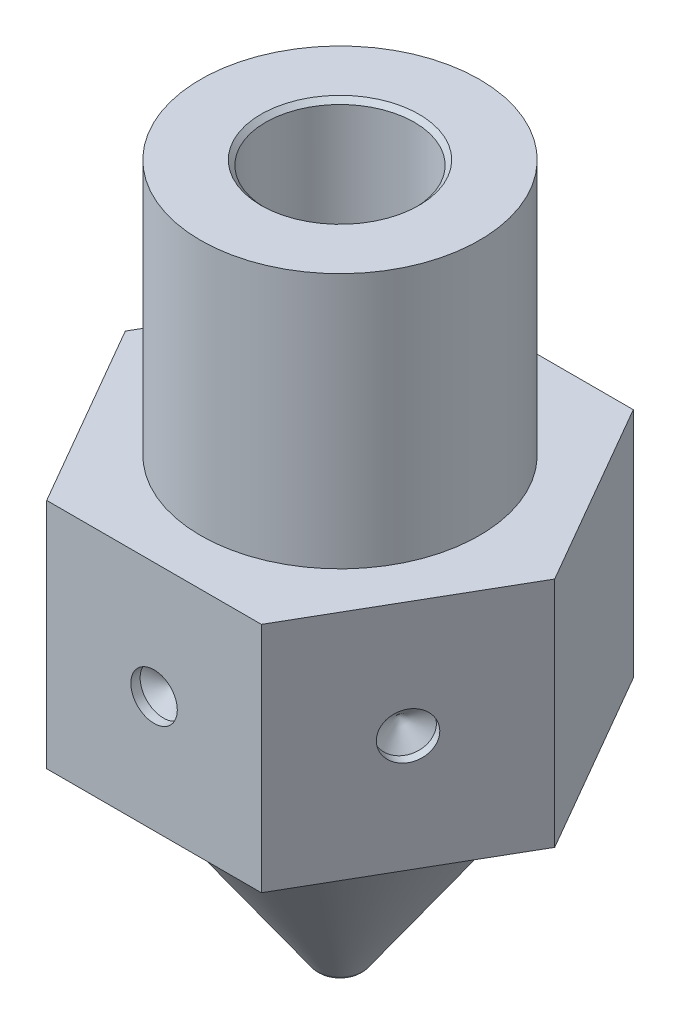
ISO-10303-21;
HEADER;
FILE_DESCRIPTION(('STEP AP214'),'2;1');
FILE_NAME('part.step','',(''),(''),'','','');
FILE_SCHEMA(('AUTOMOTIVE_DESIGN { 1 0 10303 214 1 1 1 1 }'));
ENDSEC;
DATA;
#1=APPLICATION_CONTEXT('core data for automotive mechanical design processes');
#2=APPLICATION_PROTOCOL_DEFINITION('international standard','automotive_design',2000,#1);
#3=PRODUCT_CONTEXT('',#1,'mechanical');
#4=PRODUCT('Part','Part','',(#3));
#5=PRODUCT_RELATED_PRODUCT_CATEGORY('part','',(#4));
#6=PRODUCT_DEFINITION_FORMATION('','',#4);
#7=PRODUCT_DEFINITION_CONTEXT('part definition',#1,'design');
#8=PRODUCT_DEFINITION('design','',#6,#7);
#9=PRODUCT_DEFINITION_SHAPE('','',#8);
#10=(LENGTH_UNIT() NAMED_UNIT(*) SI_UNIT(.MILLI.,.METRE.));
#11=(NAMED_UNIT(*) PLANE_ANGLE_UNIT() SI_UNIT($,.RADIAN.));
#12=(NAMED_UNIT(*) SI_UNIT($,.STERADIAN.) SOLID_ANGLE_UNIT());
#13=UNCERTAINTY_MEASURE_WITH_UNIT(LENGTH_MEASURE(1.E-05),#10,'distance_accuracy_value','');
#14=(GEOMETRIC_REPRESENTATION_CONTEXT(3) GLOBAL_UNCERTAINTY_ASSIGNED_CONTEXT((#13)) GLOBAL_UNIT_ASSIGNED_CONTEXT((#10,
#11,#12)) REPRESENTATION_CONTEXT('',''));
#15=CARTESIAN_POINT('',(0.,0.,0.));
#16=DIRECTION('',(0.,0.,1.));
#17=DIRECTION('',(1.,0.,0.));
#18=AXIS2_PLACEMENT_3D('',#15,#16,#17);
#19=CARTESIAN_POINT('',(3.55710403710923,4.5,0.));
#20=DIRECTION('',(0.,-1.,0.));
#21=DIRECTION('',(0.,0.,-1.));
#22=AXIS2_PLACEMENT_3D('',#19,#20,#21);
#23=PLANE('',#22);
#24=CARTESIAN_POINT('',(0.,4.5,0.));
#25=DIRECTION('',(0.,-1.,0.));
#26=DIRECTION('',(0.,0.,-1.));
#27=AXIS2_PLACEMENT_3D('',#24,#25,#26);
#28=CIRCLE('',#27,3.55710403710923);
#29=CARTESIAN_POINT('',(0.,4.5,-3.55710403710923));
#30=VERTEX_POINT('',#29);
#31=EDGE_CURVE('E183',#30,#30,#28,.T.);
#32=ORIENTED_EDGE('',*,*,#31,.F.);
#33=EDGE_LOOP('',(#32));
#34=FACE_BOUND('',#33,.T.);
#35=DIRECTION('',(1.,0.,0.));
#36=VECTOR('',#35,1.);
#37=CARTESIAN_POINT('',(3.55710403710923,4.5,-4.));
#38=LINE('',#37,#36);
#39=CARTESIAN_POINT('',(-2.3094010767585,4.5,-4.));
#40=VERTEX_POINT('',#39);
#41=CARTESIAN_POINT('',(2.3094010767585,4.5,-4.));
#42=VERTEX_POINT('',#41);
#43=EDGE_CURVE('E127',#40,#42,#38,.T.);
#44=ORIENTED_EDGE('',*,*,#43,.T.);
#45=DIRECTION('',(0.5,0.,0.866025403784438));
#46=VECTOR('',#45,1.);
#47=CARTESIAN_POINT('',(4.35337762441506,4.5,-0.459728769979613));
#48=LINE('',#47,#46);
#49=CARTESIAN_POINT('',(4.61880215351701,4.5,0.));
#50=VERTEX_POINT('',#49);
#51=EDGE_CURVE('E163',#42,#50,#48,.T.);
#52=ORIENTED_EDGE('',*,*,#51,.T.);
#53=DIRECTION('',(-0.5,0.,0.866025403784439));
#54=VECTOR('',#53,1.);
#55=CARTESIAN_POINT('',(4.35337762441506,4.5,0.459728769979613));
#56=LINE('',#55,#54);
#57=CARTESIAN_POINT('',(2.30940107675851,4.5,4.));
#58=VERTEX_POINT('',#57);
#59=EDGE_CURVE('E159',#50,#58,#56,.T.);
#60=ORIENTED_EDGE('',*,*,#59,.T.);
#61=DIRECTION('',(-1.,0.,0.));
#62=VECTOR('',#61,1.);
#63=CARTESIAN_POINT('',(3.55710403710923,4.5,4.));
#64=LINE('',#63,#62);
#65=CARTESIAN_POINT('',(-2.3094010767585,4.5,4.));
#66=VERTEX_POINT('',#65);
#67=EDGE_CURVE('E155',#58,#66,#64,.T.);
#68=ORIENTED_EDGE('',*,*,#67,.T.);
#69=DIRECTION('',(-0.500000000000001,0.,-0.866025403784438));
#70=VECTOR('',#69,1.);
#71=CARTESIAN_POINT('',(-2.57482560586044,4.5,3.54027123002039));
#72=LINE('',#71,#70);
#73=CARTESIAN_POINT('',(-4.61880215351701,4.5,0.));
#74=VERTEX_POINT('',#73);
#75=EDGE_CURVE('E151',#66,#74,#72,.T.);
#76=ORIENTED_EDGE('',*,*,#75,.T.);
#77=DIRECTION('',(0.5,0.,-0.866025403784439));
#78=VECTOR('',#77,1.);
#79=CARTESIAN_POINT('',(-2.57482560586045,4.5,-3.54027123002039));
#80=LINE('',#79,#78);
#81=EDGE_CURVE('E147',#74,#40,#80,.T.);
#82=ORIENTED_EDGE('',*,*,#81,.T.);
#83=EDGE_LOOP('',(#44,#52,#60,#68,#76,#82));
#84=FACE_BOUND('',#83,.T.);
#85=ADVANCED_FACE('F39',(#34,#84),#23,.T.);
#86=CARTESIAN_POINT('',(7.05814172815778,9.5,0.));
#87=DIRECTION('',(0.,1.,0.));
#88=DIRECTION('',(0.,0.,1.));
#89=AXIS2_PLACEMENT_3D('',#86,#87,#88);
#90=PLANE('',#89);
#91=CARTESIAN_POINT('',(0.,9.5,0.));
#92=DIRECTION('',(0.,-1.,0.));
#93=DIRECTION('',(0.,0.,-1.));
#94=AXIS2_PLACEMENT_3D('',#91,#92,#93);
#95=CIRCLE('',#94,3.);
#96=CARTESIAN_POINT('',(0.,9.5,-3.));
#97=VERTEX_POINT('',#96);
#98=EDGE_CURVE('E179',#97,#97,#95,.T.);
#99=ORIENTED_EDGE('',*,*,#98,.T.);
#100=EDGE_LOOP('',(#99));
#101=FACE_BOUND('',#100,.T.);
#102=DIRECTION('',(0.5,0.,-0.866025403784439));
#103=VECTOR('',#102,1.);
#104=CARTESIAN_POINT('',(5.2286370471772,9.5,-1.05626502004782));
#105=LINE('',#104,#103);
#106=CARTESIAN_POINT('',(2.30940107675851,9.5,4.));
#107=VERTEX_POINT('',#106);
#108=CARTESIAN_POINT('',(4.61880215351701,9.5,0.));
#109=VERTEX_POINT('',#108);
#110=EDGE_CURVE('E213',#107,#109,#105,.T.);
#111=ORIENTED_EDGE('',*,*,#110,.T.);
#112=DIRECTION('',(-0.5,0.,-0.866025403784438));
#113=VECTOR('',#112,1.);
#114=CARTESIAN_POINT('',(5.2286370471772,9.5,1.05626502004782));
#115=LINE('',#114,#113);
#116=CARTESIAN_POINT('',(2.3094010767585,9.5,-4.));
#117=VERTEX_POINT('',#116);
#118=EDGE_CURVE('E217',#109,#117,#115,.T.);
#119=ORIENTED_EDGE('',*,*,#118,.T.);
#120=DIRECTION('',(-1.,0.,0.));
#121=VECTOR('',#120,1.);
#122=CARTESIAN_POINT('',(7.05814172815778,9.5,-4.));
#123=LINE('',#122,#121);
#124=CARTESIAN_POINT('',(-2.3094010767585,9.5,-4.));
#125=VERTEX_POINT('',#124);
#126=EDGE_CURVE('E198',#117,#125,#123,.T.);
#127=ORIENTED_EDGE('',*,*,#126,.T.);
#128=DIRECTION('',(-0.5,0.,0.866025403784439));
#129=VECTOR('',#128,1.);
#130=CARTESIAN_POINT('',(-1.69956618309831,9.5,-5.05626502004782));
#131=LINE('',#130,#129);
#132=CARTESIAN_POINT('',(-4.61880215351701,9.5,0.));
#133=VERTEX_POINT('',#132);
#134=EDGE_CURVE('E202',#125,#133,#131,.T.);
#135=ORIENTED_EDGE('',*,*,#134,.T.);
#136=DIRECTION('',(0.500000000000001,0.,0.866025403784438));
#137=VECTOR('',#136,1.);
#138=CARTESIAN_POINT('',(-1.6995661830983,9.5,5.05626502004782));
#139=LINE('',#138,#137);
#140=CARTESIAN_POINT('',(-2.3094010767585,9.5,4.));
#141=VERTEX_POINT('',#140);
#142=EDGE_CURVE('E206',#133,#141,#139,.T.);
#143=ORIENTED_EDGE('',*,*,#142,.T.);
#144=DIRECTION('',(1.,0.,0.));
#145=VECTOR('',#144,1.);
#146=CARTESIAN_POINT('',(7.05814172815779,9.5,4.));
#147=LINE('',#146,#145);
#148=EDGE_CURVE('E209',#141,#107,#147,.T.);
#149=ORIENTED_EDGE('',*,*,#148,.T.);
#150=EDGE_LOOP('',(#111,#119,#127,#135,#143,#149));
#151=FACE_BOUND('',#150,.T.);
#152=ADVANCED_FACE('F241',(#101,#151),#90,.T.);
#153=CARTESIAN_POINT('',(0.,0.,0.));
#154=DIRECTION('',(0.,-1.,0.));
#155=DIRECTION('',(0.,0.,-1.));
#156=AXIS2_PLACEMENT_3D('',#153,#154,#155);
#157=CYLINDRICAL_SURFACE('',#156,0.2);
#158=CARTESIAN_POINT('',(0.,0.,0.));
#159=DIRECTION('',(0.,-1.,0.));
#160=DIRECTION('',(0.,0.,-1.));
#161=AXIS2_PLACEMENT_3D('',#158,#159,#160);
#162=CIRCLE('',#161,0.2);
#163=CARTESIAN_POINT('',(0.,0.,-0.2));
#164=VERTEX_POINT('',#163);
#165=EDGE_CURVE('E194',#164,#164,#162,.T.);
#166=ORIENTED_EDGE('',*,*,#165,.T.);
#167=EDGE_LOOP('',(#166));
#168=FACE_BOUND('',#167,.T.);
#169=CARTESIAN_POINT('',(0.,0.8,0.));
#170=DIRECTION('',(0.,-1.,0.));
#171=DIRECTION('',(0.,0.,-1.));
#172=AXIS2_PLACEMENT_3D('',#169,#170,#171);
#173=CIRCLE('',#172,0.2);
#174=CARTESIAN_POINT('',(0.,0.8,-0.2));
#175=VERTEX_POINT('',#174);
#176=EDGE_CURVE('E167',#175,#175,#173,.T.);
#177=ORIENTED_EDGE('',*,*,#176,.F.);
#178=EDGE_LOOP('',(#177));
#179=FACE_BOUND('',#178,.T.);
#180=ADVANCED_FACE('F247',(#168,#179),#157,.F.);
#181=CARTESIAN_POINT('',(0.2,0.,0.));
#182=DIRECTION('',(0.,-1.,0.));
#183=DIRECTION('',(0.,0.,-1.));
#184=AXIS2_PLACEMENT_3D('',#181,#182,#183);
#185=PLANE('',#184);
#186=CARTESIAN_POINT('',(0.,0.,0.));
#187=DIRECTION('',(0.,-1.,0.));
#188=DIRECTION('',(0.,0.,-1.));
#189=AXIS2_PLACEMENT_3D('',#186,#187,#188);
#190=CIRCLE('',#189,0.25);
#191=CARTESIAN_POINT('',(0.,0.,-0.25));
#192=VERTEX_POINT('',#191);
#193=EDGE_CURVE('E191',#192,#192,#190,.T.);
#194=ORIENTED_EDGE('',*,*,#193,.T.);
#195=EDGE_LOOP('',(#194));
#196=FACE_BOUND('',#195,.T.);
#197=ORIENTED_EDGE('',*,*,#165,.F.);
#198=EDGE_LOOP('',(#197));
#199=FACE_BOUND('',#198,.T.);
#200=ADVANCED_FACE('F262',(#196,#199),#185,.T.);
#201=CARTESIAN_POINT('',(0.,0.3,0.));
#202=DIRECTION('',(0.,-1.,0.));
#203=DIRECTION('',(0.,0.,-1.));
#204=AXIS2_PLACEMENT_3D('',#201,#202,#203);
#205=DEGENERATE_TOROIDAL_SURFACE('',#204,0.25,0.3,.T.);
#206=CARTESIAN_POINT('',(0.,0.127927069094686,0.));
#207=DIRECTION('',(0.,-1.,0.));
#208=DIRECTION('',(0.,0.,-1.));
#209=AXIS2_PLACEMENT_3D('',#206,#207,#208);
#210=CIRCLE('',#209,0.495745613286697);
#211=CARTESIAN_POINT('',(0.,0.127927069094686,-0.495745613286697));
#212=VERTEX_POINT('',#211);
#213=EDGE_CURVE('E187',#212,#212,#210,.T.);
#214=ORIENTED_EDGE('',*,*,#213,.T.);
#215=EDGE_LOOP('',(#214));
#216=FACE_BOUND('',#215,.T.);
#217=ORIENTED_EDGE('',*,*,#193,.F.);
#218=EDGE_LOOP('',(#217));
#219=FACE_BOUND('',#218,.T.);
#220=ADVANCED_FACE('F258',(#216,#219),#205,.T.);
#221=CARTESIAN_POINT('',(0.,0.127927069094686,0.));
#222=DIRECTION('',(0.,1.,0.));
#223=DIRECTION('',(0.,0.,1.));
#224=AXIS2_PLACEMENT_3D('',#221,#222,#223);
#225=CONICAL_SURFACE('',#224,0.495745613286697,0.610865238198017);
#226=ORIENTED_EDGE('',*,*,#31,.T.);
#227=EDGE_LOOP('',(#226));
#228=FACE_BOUND('',#227,.T.);
#229=ORIENTED_EDGE('',*,*,#213,.F.);
#230=EDGE_LOOP('',(#229));
#231=FACE_BOUND('',#230,.T.);
#232=ADVANCED_FACE('F254',(#228,#231),#225,.T.);
#233=CARTESIAN_POINT('',(0.,0.,0.));
#234=DIRECTION('',(0.,-1.,0.));
#235=DIRECTION('',(0.,0.,-1.));
#236=AXIS2_PLACEMENT_3D('',#233,#234,#235);
#237=CYLINDRICAL_SURFACE('',#236,3.);
#238=CARTESIAN_POINT('',(0.,15.,0.));
#239=DIRECTION('',(0.,-1.,0.));
#240=DIRECTION('',(0.,0.,-1.));
#241=AXIS2_PLACEMENT_3D('',#238,#239,#240);
#242=CIRCLE('',#241,3.);
#243=CARTESIAN_POINT('',(0.,15.,-3.));
#244=VERTEX_POINT('',#243);
#245=EDGE_CURVE('E175',#244,#244,#242,.T.);
#246=ORIENTED_EDGE('',*,*,#245,.T.);
#247=EDGE_LOOP('',(#246));
#248=FACE_BOUND('',#247,.T.);
#249=ORIENTED_EDGE('',*,*,#98,.F.);
#250=EDGE_LOOP('',(#249));
#251=FACE_BOUND('',#250,.T.);
#252=ADVANCED_FACE('F257',(#248,#251),#237,.T.);
#253=CARTESIAN_POINT('',(3.,15.,0.));
#254=DIRECTION('',(0.,1.,0.));
#255=DIRECTION('',(0.,0.,1.));
#256=AXIS2_PLACEMENT_3D('',#253,#254,#255);
#257=PLANE('',#256);
#258=CARTESIAN_POINT('',(0.,15.,0.));
#259=DIRECTION('',(0.,1.,0.));
#260=DIRECTION('',(0.,0.,1.));
#261=AXIS2_PLACEMENT_3D('',#258,#259,#260);
#262=CIRCLE('',#261,1.7);
#263=CARTESIAN_POINT('',(0.,15.,1.7));
#264=VERTEX_POINT('',#263);
#265=EDGE_CURVE('E48',#264,#264,#262,.F.);
#266=ORIENTED_EDGE('',*,*,#265,.T.);
#267=EDGE_LOOP('',(#266));
#268=FACE_BOUND('',#267,.T.);
#269=ORIENTED_EDGE('',*,*,#245,.F.);
#270=EDGE_LOOP('',(#269));
#271=FACE_BOUND('',#270,.T.);
#272=ADVANCED_FACE('F224',(#268,#271),#257,.T.);
#273=CARTESIAN_POINT('',(0.,0.,0.));
#274=DIRECTION('',(0.,-1.,0.));
#275=DIRECTION('',(0.,0.,-1.));
#276=AXIS2_PLACEMENT_3D('',#273,#274,#275);
#277=CYLINDRICAL_SURFACE('',#276,1.6);
#278=CARTESIAN_POINT('',(0.,14.9,0.));
#279=DIRECTION('',(0.,1.,0.));
#280=DIRECTION('',(0.,0.,1.));
#281=AXIS2_PLACEMENT_3D('',#278,#279,#280);
#282=CIRCLE('',#281,1.6);
#283=CARTESIAN_POINT('',(0.,14.9,1.6));
#284=VERTEX_POINT('',#283);
#285=EDGE_CURVE('E12',#284,#284,#282,.T.);
#286=ORIENTED_EDGE('',*,*,#285,.T.);
#287=EDGE_LOOP('',(#286));
#288=FACE_BOUND('',#287,.T.);
#289=CARTESIAN_POINT('',(0.,2.79940720943896,0.));
#290=DIRECTION('',(0.,-1.,0.));
#291=DIRECTION('',(0.,0.,-1.));
#292=AXIS2_PLACEMENT_3D('',#289,#290,#291);
#293=CIRCLE('',#292,1.6);
#294=CARTESIAN_POINT('',(0.,2.79940720943896,-1.6));
#295=VERTEX_POINT('',#294);
#296=EDGE_CURVE('E171',#295,#295,#293,.T.);
#297=ORIENTED_EDGE('',*,*,#296,.T.);
#298=EDGE_LOOP('',(#297));
#299=FACE_BOUND('',#298,.T.);
#300=ADVANCED_FACE('F278',(#288,#299),#277,.F.);
#301=CARTESIAN_POINT('',(0.,2.79940720943896,0.));
#302=DIRECTION('',(0.,1.,0.));
#303=DIRECTION('',(0.,0.,1.));
#304=AXIS2_PLACEMENT_3D('',#301,#302,#303);
#305=CONICAL_SURFACE('',#304,1.6,0.610865238198017);
#306=ORIENTED_EDGE('',*,*,#176,.T.);
#307=EDGE_LOOP('',(#306));
#308=FACE_BOUND('',#307,.T.);
#309=ORIENTED_EDGE('',*,*,#296,.F.);
#310=EDGE_LOOP('',(#309));
#311=FACE_BOUND('',#310,.T.);
#312=ADVANCED_FACE('F274',(#308,#311),#305,.F.);
#313=CARTESIAN_POINT('',(4.61880215351701,3.5,0.));
#314=DIRECTION('',(0.866025403784438,0.,-0.5));
#315=DIRECTION('',(-0.5,0.,-0.866025403784438));
#316=AXIS2_PLACEMENT_3D('',#313,#314,#315);
#317=PLANE('',#316);
#318=DIRECTION('',(0.,1.,0.));
#319=VECTOR('',#318,1.);
#320=CARTESIAN_POINT('',(2.3094010767585,3.5,-4.));
#321=LINE('',#320,#319);
#322=EDGE_CURVE('E55',#42,#117,#321,.T.);
#323=ORIENTED_EDGE('',*,*,#322,.T.);
#324=ORIENTED_EDGE('',*,*,#118,.F.);
#325=DIRECTION('',(0.,1.,0.));
#326=VECTOR('',#325,1.);
#327=CARTESIAN_POINT('',(4.61880215351701,3.5,0.));
#328=LINE('',#327,#326);
#329=EDGE_CURVE('E123',#50,#109,#328,.T.);
#330=ORIENTED_EDGE('',*,*,#329,.F.);
#331=ORIENTED_EDGE('',*,*,#51,.F.);
#332=EDGE_LOOP('',(#323,#324,#330,#331));
#333=FACE_BOUND('',#332,.T.);
#334=ADVANCED_FACE('F277',(#333),#317,.T.);
#335=CARTESIAN_POINT('',(2.30940107675851,3.5,4.));
#336=DIRECTION('',(0.866025403784439,0.,0.5));
#337=DIRECTION('',(0.5,0.,-0.866025403784439));
#338=AXIS2_PLACEMENT_3D('',#335,#336,#337);
#339=PLANE('',#338);
#340=CARTESIAN_POINT('',(3.46410161513776,7.,2.));
#341=DIRECTION('',(0.866025403784439,0.,0.5));
#342=DIRECTION('',(0.5,0.,-0.866025403784439));
#343=AXIS2_PLACEMENT_3D('',#340,#341,#342);
#344=CIRCLE('',#343,0.5);
#345=CARTESIAN_POINT('',(3.71410161513776,7.,1.56698729810778));
#346=VERTEX_POINT('',#345);
#347=EDGE_CURVE('E108',#346,#346,#344,.T.);
#348=ORIENTED_EDGE('',*,*,#347,.F.);
#349=EDGE_LOOP('',(#348));
#350=FACE_BOUND('',#349,.T.);
#351=ORIENTED_EDGE('',*,*,#329,.T.);
#352=ORIENTED_EDGE('',*,*,#110,.F.);
#353=DIRECTION('',(0.,1.,0.));
#354=VECTOR('',#353,1.);
#355=CARTESIAN_POINT('',(2.30940107675851,3.5,4.));
#356=LINE('',#355,#354);
#357=EDGE_CURVE('E128',#58,#107,#356,.T.);
#358=ORIENTED_EDGE('',*,*,#357,.F.);
#359=ORIENTED_EDGE('',*,*,#59,.F.);
#360=EDGE_LOOP('',(#351,#352,#358,#359));
#361=FACE_BOUND('',#360,.T.);
#362=ADVANCED_FACE('F300',(#350,#361),#339,.T.);
#363=CARTESIAN_POINT('',(-2.3094010767585,3.5,4.));
#364=DIRECTION('',(0.,0.,1.));
#365=DIRECTION('',(1.,0.,0.));
#366=AXIS2_PLACEMENT_3D('',#363,#364,#365);
#367=PLANE('',#366);
#368=CARTESIAN_POINT('',(0.,7.,4.));
#369=DIRECTION('',(0.,0.,1.));
#370=DIRECTION('',(1.,0.,0.));
#371=AXIS2_PLACEMENT_3D('',#368,#369,#370);
#372=CIRCLE('',#371,0.499999999999999);
#373=CARTESIAN_POINT('',(0.500000000000003,7.,4.));
#374=VERTEX_POINT('',#373);
#375=EDGE_CURVE('E107',#374,#374,#372,.T.);
#376=ORIENTED_EDGE('',*,*,#375,.F.);
#377=EDGE_LOOP('',(#376));
#378=FACE_BOUND('',#377,.T.);
#379=ORIENTED_EDGE('',*,*,#357,.T.);
#380=ORIENTED_EDGE('',*,*,#148,.F.);
#381=DIRECTION('',(0.,1.,0.));
#382=VECTOR('',#381,1.);
#383=CARTESIAN_POINT('',(-2.3094010767585,3.5,4.));
#384=LINE('',#383,#382);
#385=EDGE_CURVE('E132',#66,#141,#384,.T.);
#386=ORIENTED_EDGE('',*,*,#385,.F.);
#387=ORIENTED_EDGE('',*,*,#67,.F.);
#388=EDGE_LOOP('',(#379,#380,#386,#387));
#389=FACE_BOUND('',#388,.T.);
#390=ADVANCED_FACE('F303',(#378,#389),#367,.T.);
#391=CARTESIAN_POINT('',(-4.61880215351701,3.5,0.));
#392=DIRECTION('',(-0.866025403784438,0.,0.500000000000001));
#393=DIRECTION('',(0.500000000000001,0.,0.866025403784438));
#394=AXIS2_PLACEMENT_3D('',#391,#392,#393);
#395=PLANE('',#394);
#396=ORIENTED_EDGE('',*,*,#385,.T.);
#397=ORIENTED_EDGE('',*,*,#142,.F.);
#398=DIRECTION('',(0.,1.,0.));
#399=VECTOR('',#398,1.);
#400=CARTESIAN_POINT('',(-4.61880215351701,3.5,0.));
#401=LINE('',#400,#399);
#402=EDGE_CURVE('E136',#74,#133,#401,.T.);
#403=ORIENTED_EDGE('',*,*,#402,.F.);
#404=ORIENTED_EDGE('',*,*,#75,.F.);
#405=EDGE_LOOP('',(#396,#397,#403,#404));
#406=FACE_BOUND('',#405,.T.);
#407=ADVANCED_FACE('F309',(#406),#395,.T.);
#408=CARTESIAN_POINT('',(-2.3094010767585,3.5,-4.));
#409=DIRECTION('',(-0.866025403784438,0.,-0.5));
#410=DIRECTION('',(-0.5,0.,0.866025403784439));
#411=AXIS2_PLACEMENT_3D('',#408,#409,#410);
#412=PLANE('',#411);
#413=ORIENTED_EDGE('',*,*,#402,.T.);
#414=ORIENTED_EDGE('',*,*,#134,.F.);
#415=DIRECTION('',(0.,1.,0.));
#416=VECTOR('',#415,1.);
#417=CARTESIAN_POINT('',(-2.3094010767585,3.5,-4.));
#418=LINE('',#417,#416);
#419=EDGE_CURVE('E60',#40,#125,#418,.T.);
#420=ORIENTED_EDGE('',*,*,#419,.F.);
#421=ORIENTED_EDGE('',*,*,#81,.F.);
#422=EDGE_LOOP('',(#413,#414,#420,#421));
#423=FACE_BOUND('',#422,.T.);
#424=ADVANCED_FACE('F237',(#423),#412,.T.);
#425=CARTESIAN_POINT('',(2.3094010767585,3.5,-4.));
#426=DIRECTION('',(0.,0.,-1.));
#427=DIRECTION('',(-1.,0.,0.));
#428=AXIS2_PLACEMENT_3D('',#425,#426,#427);
#429=PLANE('',#428);
#430=ORIENTED_EDGE('',*,*,#419,.T.);
#431=ORIENTED_EDGE('',*,*,#126,.F.);
#432=ORIENTED_EDGE('',*,*,#322,.F.);
#433=ORIENTED_EDGE('',*,*,#43,.F.);
#434=EDGE_LOOP('',(#430,#431,#432,#433));
#435=FACE_BOUND('',#434,.T.);
#436=ADVANCED_FACE('F229',(#435),#429,.T.);
#437=CARTESIAN_POINT('',(0.,15.,0.));
#438=DIRECTION('',(0.,1.,0.));
#439=DIRECTION('',(0.,0.,1.));
#440=AXIS2_PLACEMENT_3D('',#437,#438,#439);
#441=CONICAL_SURFACE('',#440,1.7,0.785398163397439);
#442=ORIENTED_EDGE('',*,*,#285,.F.);
#443=EDGE_LOOP('',(#442));
#444=FACE_BOUND('',#443,.T.);
#445=ORIENTED_EDGE('',*,*,#265,.F.);
#446=EDGE_LOOP('',(#445));
#447=FACE_BOUND('',#446,.T.);
#448=ADVANCED_FACE('F41',(#444,#447),#441,.F.);
#449=CARTESIAN_POINT('',(0.,7.,3.8));
#450=DIRECTION('',(0.,0.,1.));
#451=DIRECTION('',(1.,0.,0.));
#452=AXIS2_PLACEMENT_3D('',#449,#450,#451);
#453=CONICAL_SURFACE('',#452,0.499999999999999,1.02974425867665);
#454=CARTESIAN_POINT('',(0.,7.,3.49956969048622));
#455=VERTEX_POINT('',#454);
#456=VERTEX_LOOP('',#455);
#457=FACE_BOUND('',#456,.T.);
#458=CARTESIAN_POINT('',(0.,7.,3.8));
#459=DIRECTION('',(0.,0.,1.));
#460=DIRECTION('',(1.,0.,0.));
#461=AXIS2_PLACEMENT_3D('',#458,#459,#460);
#462=CIRCLE('',#461,0.499999999999999);
#463=CARTESIAN_POINT('',(0.500000000000003,7.,3.8));
#464=VERTEX_POINT('',#463);
#465=EDGE_CURVE('E114',#464,#464,#462,.T.);
#466=ORIENTED_EDGE('',*,*,#465,.T.);
#467=EDGE_LOOP('',(#466));
#468=FACE_BOUND('',#467,.T.);
#469=ADVANCED_FACE('F228',(#457,#468),#453,.F.);
#470=CARTESIAN_POINT('',(0.,7.,4.));
#471=DIRECTION('',(0.,0.,1.));
#472=DIRECTION('',(1.,0.,0.));
#473=AXIS2_PLACEMENT_3D('',#470,#471,#472);
#474=CYLINDRICAL_SURFACE('',#473,0.499999999999999);
#475=ORIENTED_EDGE('',*,*,#465,.F.);
#476=EDGE_LOOP('',(#475));
#477=FACE_BOUND('',#476,.T.);
#478=ORIENTED_EDGE('',*,*,#375,.T.);
#479=EDGE_LOOP('',(#478));
#480=FACE_BOUND('',#479,.T.);
#481=ADVANCED_FACE('F100',(#477,#480),#474,.F.);
#482=CARTESIAN_POINT('',(3.29089653438087,7.,1.9));
#483=DIRECTION('',(0.866025403784439,0.,0.5));
#484=DIRECTION('',(0.5,0.,-0.866025403784439));
#485=AXIS2_PLACEMENT_3D('',#482,#483,#484);
#486=CONICAL_SURFACE('',#485,0.5,1.02974425867665);
#487=CARTESIAN_POINT('',(3.03071625427511,7.,1.74978484524311));
#488=VERTEX_POINT('',#487);
#489=VERTEX_LOOP('',#488);
#490=FACE_BOUND('',#489,.T.);
#491=CARTESIAN_POINT('',(3.29089653438087,7.,1.9));
#492=DIRECTION('',(0.866025403784439,0.,0.5));
#493=DIRECTION('',(0.5,0.,-0.866025403784439));
#494=AXIS2_PLACEMENT_3D('',#491,#492,#493);
#495=CIRCLE('',#494,0.5);
#496=CARTESIAN_POINT('',(3.54089653438087,7.,1.46698729810778));
#497=VERTEX_POINT('',#496);
#498=EDGE_CURVE('E104',#497,#497,#495,.T.);
#499=ORIENTED_EDGE('',*,*,#498,.T.);
#500=EDGE_LOOP('',(#499));
#501=FACE_BOUND('',#500,.T.);
#502=ADVANCED_FACE('F96',(#490,#501),#486,.F.);
#503=CARTESIAN_POINT('',(3.46410161513776,7.,2.));
#504=DIRECTION('',(0.866025403784439,0.,0.5));
#505=DIRECTION('',(0.5,0.,-0.866025403784439));
#506=AXIS2_PLACEMENT_3D('',#503,#504,#505);
#507=CYLINDRICAL_SURFACE('',#506,0.5);
#508=ORIENTED_EDGE('',*,*,#498,.F.);
#509=EDGE_LOOP('',(#508));
#510=FACE_BOUND('',#509,.T.);
#511=ORIENTED_EDGE('',*,*,#347,.T.);
#512=EDGE_LOOP('',(#511));
#513=FACE_BOUND('',#512,.T.);
#514=ADVANCED_FACE('F99',(#510,#513),#507,.F.);
#515=CLOSED_SHELL('',(#85,#152,#180,#200,#220,#232,#252,#272,#300,#312,#334,#362,#390,#407,#424,
#436,#448,#469,#481,#502,#514));
#516=MANIFOLD_SOLID_BREP('B2',#515);
#517=ADVANCED_BREP_SHAPE_REPRESENTATION('',(#18,#516),#14);
#518=SHAPE_DEFINITION_REPRESENTATION(#9,#517);
ENDSEC;
END-ISO-10303-21;
